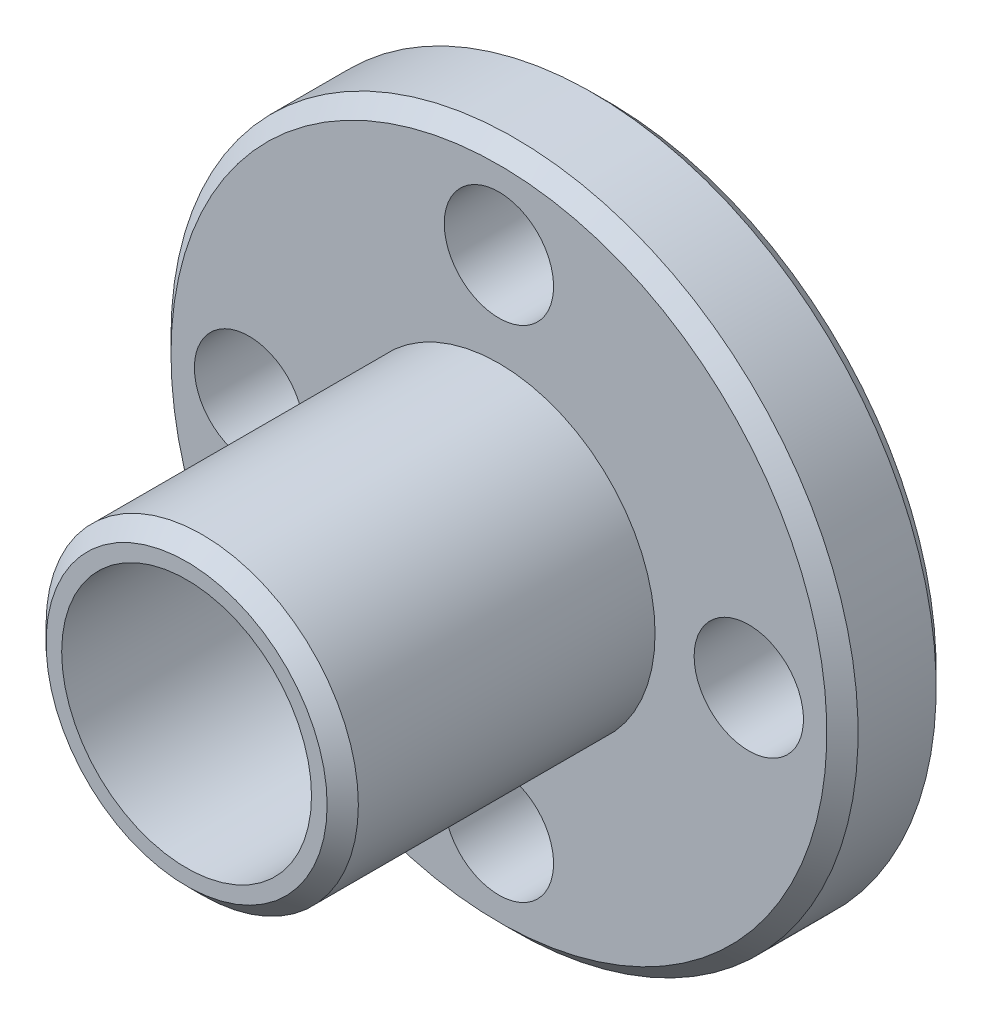
ISO-10303-21;
HEADER;
FILE_DESCRIPTION(('STEP AP214'),'2;1');
FILE_NAME('part.step','',(''),(''),'','','');
FILE_SCHEMA(('AUTOMOTIVE_DESIGN { 1 0 10303 214 1 1 1 1 }'));
ENDSEC;
DATA;
#1=APPLICATION_CONTEXT('core data for automotive mechanical design processes');
#2=APPLICATION_PROTOCOL_DEFINITION('international standard','automotive_design',2000,#1);
#3=PRODUCT_CONTEXT('',#1,'mechanical');
#4=PRODUCT('Part','Part','',(#3));
#5=PRODUCT_RELATED_PRODUCT_CATEGORY('part','',(#4));
#6=PRODUCT_DEFINITION_FORMATION('','',#4);
#7=PRODUCT_DEFINITION_CONTEXT('part definition',#1,'design');
#8=PRODUCT_DEFINITION('design','',#6,#7);
#9=PRODUCT_DEFINITION_SHAPE('','',#8);
#10=(LENGTH_UNIT() NAMED_UNIT(*) SI_UNIT(.MILLI.,.METRE.));
#11=(NAMED_UNIT(*) PLANE_ANGLE_UNIT() SI_UNIT($,.RADIAN.));
#12=(NAMED_UNIT(*) SI_UNIT($,.STERADIAN.) SOLID_ANGLE_UNIT());
#13=UNCERTAINTY_MEASURE_WITH_UNIT(LENGTH_MEASURE(1.E-05),#10,'distance_accuracy_value','');
#14=(GEOMETRIC_REPRESENTATION_CONTEXT(3) GLOBAL_UNCERTAINTY_ASSIGNED_CONTEXT((#13)) GLOBAL_UNIT_ASSIGNED_CONTEXT((#10,
#11,#12)) REPRESENTATION_CONTEXT('',''));
#15=CARTESIAN_POINT('',(0.,0.,0.));
#16=DIRECTION('',(0.,0.,1.));
#17=DIRECTION('',(1.,0.,0.));
#18=AXIS2_PLACEMENT_3D('',#15,#16,#17);
#19=CARTESIAN_POINT('',(0.,0.,7.5));
#20=DIRECTION('',(0.,0.,-1.));
#21=DIRECTION('',(-1.,0.,0.));
#22=AXIS2_PLACEMENT_3D('',#19,#20,#21);
#23=CYLINDRICAL_SURFACE('',#22,5.);
#24=CARTESIAN_POINT('',(0.,0.,6.99999999999999));
#25=DIRECTION('',(0.,0.,1.));
#26=DIRECTION('',(1.,0.,0.));
#27=AXIS2_PLACEMENT_3D('',#24,#25,#26);
#28=CIRCLE('',#27,5.);
#29=CARTESIAN_POINT('',(5.,0.,6.99999999999999));
#30=VERTEX_POINT('',#29);
#31=EDGE_CURVE('E60',#30,#30,#28,.F.);
#32=ORIENTED_EDGE('',*,*,#31,.T.);
#33=EDGE_LOOP('',(#32));
#34=FACE_BOUND('',#33,.T.);
#35=CARTESIAN_POINT('',(0.,0.,-2.5));
#36=DIRECTION('',(0.,0.,-1.));
#37=DIRECTION('',(-1.,0.,0.));
#38=AXIS2_PLACEMENT_3D('',#35,#36,#37);
#39=CIRCLE('',#38,5.);
#40=CARTESIAN_POINT('',(-5.,0.,-2.5));
#41=VERTEX_POINT('',#40);
#42=EDGE_CURVE('E66',#41,#41,#39,.T.);
#43=ORIENTED_EDGE('',*,*,#42,.F.);
#44=EDGE_LOOP('',(#43));
#45=FACE_BOUND('',#44,.T.);
#46=ADVANCED_FACE('F33',(#34,#45),#23,.T.);
#47=CARTESIAN_POINT('',(0.,0.,7.5));
#48=DIRECTION('',(0.,0.,1.));
#49=DIRECTION('',(1.,0.,0.));
#50=AXIS2_PLACEMENT_3D('',#47,#48,#49);
#51=PLANE('',#50);
#52=CARTESIAN_POINT('',(0.,0.,7.5));
#53=DIRECTION('',(0.,0.,1.));
#54=DIRECTION('',(1.,0.,0.));
#55=AXIS2_PLACEMENT_3D('',#52,#53,#54);
#56=CIRCLE('',#55,4.5);
#57=CARTESIAN_POINT('',(4.5,0.,7.5));
#58=VERTEX_POINT('',#57);
#59=EDGE_CURVE('E63',#58,#58,#56,.T.);
#60=ORIENTED_EDGE('',*,*,#59,.T.);
#61=EDGE_LOOP('',(#60));
#62=FACE_BOUND('',#61,.T.);
#63=CARTESIAN_POINT('',(0.,0.,7.5));
#64=DIRECTION('',(0.,0.,-1.));
#65=DIRECTION('',(-1.,0.,0.));
#66=AXIS2_PLACEMENT_3D('',#63,#64,#65);
#67=CIRCLE('',#66,4.);
#68=CARTESIAN_POINT('',(-4.,0.,7.5));
#69=VERTEX_POINT('',#68);
#70=EDGE_CURVE('E72',#69,#69,#67,.T.);
#71=ORIENTED_EDGE('',*,*,#70,.T.);
#72=EDGE_LOOP('',(#71));
#73=FACE_BOUND('',#72,.T.);
#74=ADVANCED_FACE('F136',(#62,#73),#51,.T.);
#75=CARTESIAN_POINT('',(0.,0.,-2.5));
#76=DIRECTION('',(0.,0.,-1.));
#77=DIRECTION('',(-1.,0.,0.));
#78=AXIS2_PLACEMENT_3D('',#75,#76,#77);
#79=CYLINDRICAL_SURFACE('',#78,11.);
#80=CARTESIAN_POINT('',(0.,0.,-3.00000000000001));
#81=DIRECTION('',(0.,0.,-1.));
#82=DIRECTION('',(-1.,0.,0.));
#83=AXIS2_PLACEMENT_3D('',#80,#81,#82);
#84=CIRCLE('',#83,11.);
#85=CARTESIAN_POINT('',(-11.,0.,-3.00000000000001));
#86=VERTEX_POINT('',#85);
#87=EDGE_CURVE('E54',#86,#86,#84,.T.);
#88=ORIENTED_EDGE('',*,*,#87,.T.);
#89=EDGE_LOOP('',(#88));
#90=FACE_BOUND('',#89,.T.);
#91=CARTESIAN_POINT('',(0.,0.,-5.5));
#92=DIRECTION('',(0.,0.,-1.));
#93=DIRECTION('',(-1.,0.,0.));
#94=AXIS2_PLACEMENT_3D('',#91,#92,#93);
#95=CIRCLE('',#94,11.);
#96=CARTESIAN_POINT('',(-11.,0.,-5.5));
#97=VERTEX_POINT('',#96);
#98=EDGE_CURVE('E57',#97,#97,#95,.F.);
#99=ORIENTED_EDGE('',*,*,#98,.T.);
#100=EDGE_LOOP('',(#99));
#101=FACE_BOUND('',#100,.T.);
#102=ADVANCED_FACE('F142',(#90,#101),#79,.T.);
#103=CARTESIAN_POINT('',(0.,0.,-2.5));
#104=DIRECTION('',(0.,0.,-1.));
#105=DIRECTION('',(-1.,0.,0.));
#106=AXIS2_PLACEMENT_3D('',#103,#104,#105);
#107=PLANE('',#106);
#108=CARTESIAN_POINT('',(0.,0.,-2.5));
#109=DIRECTION('',(0.,0.,-1.));
#110=DIRECTION('',(-1.,0.,0.));
#111=AXIS2_PLACEMENT_3D('',#108,#109,#110);
#112=CIRCLE('',#111,10.5);
#113=CARTESIAN_POINT('',(-10.5,0.,-2.5));
#114=VERTEX_POINT('',#113);
#115=EDGE_CURVE('E49',#114,#114,#112,.F.);
#116=ORIENTED_EDGE('',*,*,#115,.T.);
#117=EDGE_LOOP('',(#116));
#118=FACE_BOUND('',#117,.T.);
#119=CARTESIAN_POINT('',(0.,8.,-2.5));
#120=DIRECTION('',(0.,0.,-1.));
#121=DIRECTION('',(-1.,0.,0.));
#122=AXIS2_PLACEMENT_3D('',#119,#120,#121);
#123=CIRCLE('',#122,1.75);
#124=CARTESIAN_POINT('',(-1.75,8.,-2.5));
#125=VERTEX_POINT('',#124);
#126=EDGE_CURVE('E76',#125,#125,#123,.T.);
#127=ORIENTED_EDGE('',*,*,#126,.T.);
#128=EDGE_LOOP('',(#127));
#129=FACE_BOUND('',#128,.T.);
#130=CARTESIAN_POINT('',(-8.,0.,-2.5));
#131=DIRECTION('',(0.,0.,-1.));
#132=DIRECTION('',(-1.,0.,0.));
#133=AXIS2_PLACEMENT_3D('',#130,#131,#132);
#134=CIRCLE('',#133,1.75);
#135=CARTESIAN_POINT('',(-9.75,0.,-2.5));
#136=VERTEX_POINT('',#135);
#137=EDGE_CURVE('E81',#136,#136,#134,.T.);
#138=ORIENTED_EDGE('',*,*,#137,.T.);
#139=EDGE_LOOP('',(#138));
#140=FACE_BOUND('',#139,.T.);
#141=CARTESIAN_POINT('',(0.,-8.,-2.5));
#142=DIRECTION('',(0.,0.,-1.));
#143=DIRECTION('',(-1.,0.,0.));
#144=AXIS2_PLACEMENT_3D('',#141,#142,#143);
#145=CIRCLE('',#144,1.75);
#146=CARTESIAN_POINT('',(-1.75,-8.,-2.5));
#147=VERTEX_POINT('',#146);
#148=EDGE_CURVE('E84',#147,#147,#145,.T.);
#149=ORIENTED_EDGE('',*,*,#148,.T.);
#150=EDGE_LOOP('',(#149));
#151=FACE_BOUND('',#150,.T.);
#152=CARTESIAN_POINT('',(8.,0.,-2.5));
#153=DIRECTION('',(0.,0.,-1.));
#154=DIRECTION('',(-1.,0.,0.));
#155=AXIS2_PLACEMENT_3D('',#152,#153,#154);
#156=CIRCLE('',#155,1.75);
#157=CARTESIAN_POINT('',(6.25,0.,-2.5));
#158=VERTEX_POINT('',#157);
#159=EDGE_CURVE('E87',#158,#158,#156,.T.);
#160=ORIENTED_EDGE('',*,*,#159,.T.);
#161=EDGE_LOOP('',(#160));
#162=FACE_BOUND('',#161,.T.);
#163=ORIENTED_EDGE('',*,*,#42,.T.);
#164=EDGE_LOOP('',(#163));
#165=FACE_BOUND('',#164,.T.);
#166=ADVANCED_FACE('F110',(#118,#129,#140,#151,#162,#165),#107,.F.);
#167=CARTESIAN_POINT('',(0.,0.,-6.));
#168=DIRECTION('',(0.,0.,-1.));
#169=DIRECTION('',(-1.,0.,0.));
#170=AXIS2_PLACEMENT_3D('',#167,#168,#169);
#171=PLANE('',#170);
#172=CARTESIAN_POINT('',(0.,0.,-6.));
#173=DIRECTION('',(0.,0.,-1.));
#174=DIRECTION('',(-1.,0.,0.));
#175=AXIS2_PLACEMENT_3D('',#172,#173,#174);
#176=CIRCLE('',#175,10.5);
#177=CARTESIAN_POINT('',(-10.5,0.,-6.));
#178=VERTEX_POINT('',#177);
#179=EDGE_CURVE('E45',#178,#178,#176,.T.);
#180=ORIENTED_EDGE('',*,*,#179,.T.);
#181=EDGE_LOOP('',(#180));
#182=FACE_BOUND('',#181,.T.);
#183=CARTESIAN_POINT('',(0.,8.,-6.));
#184=DIRECTION('',(0.,0.,-1.));
#185=DIRECTION('',(-1.,0.,0.));
#186=AXIS2_PLACEMENT_3D('',#183,#184,#185);
#187=CIRCLE('',#186,1.75);
#188=CARTESIAN_POINT('',(-1.75,8.,-6.));
#189=VERTEX_POINT('',#188);
#190=EDGE_CURVE('E90',#189,#189,#187,.T.);
#191=ORIENTED_EDGE('',*,*,#190,.F.);
#192=EDGE_LOOP('',(#191));
#193=FACE_BOUND('',#192,.T.);
#194=CARTESIAN_POINT('',(-8.,0.,-6.));
#195=DIRECTION('',(0.,0.,-1.));
#196=DIRECTION('',(-1.,0.,0.));
#197=AXIS2_PLACEMENT_3D('',#194,#195,#196);
#198=CIRCLE('',#197,1.75);
#199=CARTESIAN_POINT('',(-9.75,0.,-6.));
#200=VERTEX_POINT('',#199);
#201=EDGE_CURVE('E97',#200,#200,#198,.T.);
#202=ORIENTED_EDGE('',*,*,#201,.F.);
#203=EDGE_LOOP('',(#202));
#204=FACE_BOUND('',#203,.T.);
#205=CARTESIAN_POINT('',(0.,-8.,-6.));
#206=DIRECTION('',(0.,0.,-1.));
#207=DIRECTION('',(-1.,0.,0.));
#208=AXIS2_PLACEMENT_3D('',#205,#206,#207);
#209=CIRCLE('',#208,1.75);
#210=CARTESIAN_POINT('',(-1.75,-8.,-6.));
#211=VERTEX_POINT('',#210);
#212=EDGE_CURVE('E94',#211,#211,#209,.T.);
#213=ORIENTED_EDGE('',*,*,#212,.F.);
#214=EDGE_LOOP('',(#213));
#215=FACE_BOUND('',#214,.T.);
#216=CARTESIAN_POINT('',(8.,0.,-6.));
#217=DIRECTION('',(0.,0.,-1.));
#218=DIRECTION('',(-1.,0.,0.));
#219=AXIS2_PLACEMENT_3D('',#216,#217,#218);
#220=CIRCLE('',#219,1.75);
#221=CARTESIAN_POINT('',(6.25,0.,-6.));
#222=VERTEX_POINT('',#221);
#223=EDGE_CURVE('E91',#222,#222,#220,.T.);
#224=ORIENTED_EDGE('',*,*,#223,.F.);
#225=EDGE_LOOP('',(#224));
#226=FACE_BOUND('',#225,.T.);
#227=CARTESIAN_POINT('',(0.,0.,-6.));
#228=DIRECTION('',(0.,0.,-1.));
#229=DIRECTION('',(-1.,0.,0.));
#230=AXIS2_PLACEMENT_3D('',#227,#228,#229);
#231=CIRCLE('',#230,5.);
#232=CARTESIAN_POINT('',(-5.,0.,-6.));
#233=VERTEX_POINT('',#232);
#234=EDGE_CURVE('E69',#233,#233,#231,.T.);
#235=ORIENTED_EDGE('',*,*,#234,.F.);
#236=EDGE_LOOP('',(#235));
#237=FACE_BOUND('',#236,.T.);
#238=ADVANCED_FACE('F106',(#182,#193,#204,#215,#226,#237),#171,.T.);
#239=CARTESIAN_POINT('',(0.,0.,-7.5));
#240=DIRECTION('',(0.,0.,1.));
#241=DIRECTION('',(1.,0.,0.));
#242=AXIS2_PLACEMENT_3D('',#239,#240,#241);
#243=PLANE('',#242);
#244=CARTESIAN_POINT('',(0.,0.,-7.5));
#245=DIRECTION('',(0.,0.,1.));
#246=DIRECTION('',(1.,0.,0.));
#247=AXIS2_PLACEMENT_3D('',#244,#245,#246);
#248=CIRCLE('',#247,4.5);
#249=CARTESIAN_POINT('',(4.5,0.,-7.5));
#250=VERTEX_POINT('',#249);
#251=EDGE_CURVE('E10',#250,#250,#248,.F.);
#252=ORIENTED_EDGE('',*,*,#251,.T.);
#253=EDGE_LOOP('',(#252));
#254=FACE_BOUND('',#253,.T.);
#255=CARTESIAN_POINT('',(0.,0.,-7.5));
#256=DIRECTION('',(0.,0.,-1.));
#257=DIRECTION('',(-1.,0.,0.));
#258=AXIS2_PLACEMENT_3D('',#255,#256,#257);
#259=CIRCLE('',#258,4.);
#260=CARTESIAN_POINT('',(-4.,0.,-7.5));
#261=VERTEX_POINT('',#260);
#262=EDGE_CURVE('E73',#261,#261,#259,.T.);
#263=ORIENTED_EDGE('',*,*,#262,.F.);
#264=EDGE_LOOP('',(#263));
#265=FACE_BOUND('',#264,.T.);
#266=ADVANCED_FACE('F109',(#254,#265),#243,.F.);
#267=CARTESIAN_POINT('',(0.,0.,-7.));
#268=DIRECTION('',(0.,0.,1.));
#269=DIRECTION('',(1.,0.,0.));
#270=AXIS2_PLACEMENT_3D('',#267,#268,#269);
#271=CIRCLE('',#270,5.);
#272=CARTESIAN_POINT('',(5.,0.,-7.));
#273=VERTEX_POINT('',#272);
#274=EDGE_CURVE('E41',#273,#273,#271,.T.);
#275=ORIENTED_EDGE('',*,*,#274,.T.);
#276=EDGE_LOOP('',(#275));
#277=FACE_BOUND('',#276,.T.);
#278=ORIENTED_EDGE('',*,*,#234,.T.);
#279=EDGE_LOOP('',(#278));
#280=FACE_BOUND('',#279,.T.);
#281=ADVANCED_FACE('F121',(#277,#280),#23,.T.);
#282=CARTESIAN_POINT('',(0.,0.,7.5));
#283=DIRECTION('',(0.,0.,-1.));
#284=DIRECTION('',(-1.,0.,0.));
#285=AXIS2_PLACEMENT_3D('',#282,#283,#284);
#286=CYLINDRICAL_SURFACE('',#285,4.);
#287=ORIENTED_EDGE('',*,*,#70,.F.);
#288=EDGE_LOOP('',(#287));
#289=FACE_BOUND('',#288,.T.);
#290=ORIENTED_EDGE('',*,*,#262,.T.);
#291=EDGE_LOOP('',(#290));
#292=FACE_BOUND('',#291,.T.);
#293=ADVANCED_FACE('F123',(#289,#292),#286,.F.);
#294=CARTESIAN_POINT('',(8.,0.,7.5));
#295=DIRECTION('',(0.,0.,-1.));
#296=DIRECTION('',(-1.,0.,0.));
#297=AXIS2_PLACEMENT_3D('',#294,#295,#296);
#298=CYLINDRICAL_SURFACE('',#297,1.75);
#299=ORIENTED_EDGE('',*,*,#223,.T.);
#300=EDGE_LOOP('',(#299));
#301=FACE_BOUND('',#300,.T.);
#302=ORIENTED_EDGE('',*,*,#159,.F.);
#303=EDGE_LOOP('',(#302));
#304=FACE_BOUND('',#303,.T.);
#305=ADVANCED_FACE('F130',(#301,#304),#298,.F.);
#306=CARTESIAN_POINT('',(0.,-8.,7.5));
#307=DIRECTION('',(0.,0.,-1.));
#308=DIRECTION('',(-1.,0.,0.));
#309=AXIS2_PLACEMENT_3D('',#306,#307,#308);
#310=CYLINDRICAL_SURFACE('',#309,1.75);
#311=ORIENTED_EDGE('',*,*,#212,.T.);
#312=EDGE_LOOP('',(#311));
#313=FACE_BOUND('',#312,.T.);
#314=ORIENTED_EDGE('',*,*,#148,.F.);
#315=EDGE_LOOP('',(#314));
#316=FACE_BOUND('',#315,.T.);
#317=ADVANCED_FACE('F161',(#313,#316),#310,.F.);
#318=CARTESIAN_POINT('',(-8.,0.,7.5));
#319=DIRECTION('',(0.,0.,-1.));
#320=DIRECTION('',(-1.,0.,0.));
#321=AXIS2_PLACEMENT_3D('',#318,#319,#320);
#322=CYLINDRICAL_SURFACE('',#321,1.75);
#323=ORIENTED_EDGE('',*,*,#201,.T.);
#324=EDGE_LOOP('',(#323));
#325=FACE_BOUND('',#324,.T.);
#326=ORIENTED_EDGE('',*,*,#137,.F.);
#327=EDGE_LOOP('',(#326));
#328=FACE_BOUND('',#327,.T.);
#329=ADVANCED_FACE('F165',(#325,#328),#322,.F.);
#330=CARTESIAN_POINT('',(0.,8.,7.5));
#331=DIRECTION('',(0.,0.,-1.));
#332=DIRECTION('',(-1.,0.,0.));
#333=AXIS2_PLACEMENT_3D('',#330,#331,#332);
#334=CYLINDRICAL_SURFACE('',#333,1.75);
#335=ORIENTED_EDGE('',*,*,#190,.T.);
#336=EDGE_LOOP('',(#335));
#337=FACE_BOUND('',#336,.T.);
#338=ORIENTED_EDGE('',*,*,#126,.F.);
#339=EDGE_LOOP('',(#338));
#340=FACE_BOUND('',#339,.T.);
#341=ADVANCED_FACE('F103',(#337,#340),#334,.F.);
#342=CARTESIAN_POINT('',(0.,0.,7.5));
#343=DIRECTION('',(0.,0.,-1.));
#344=DIRECTION('',(-1.,0.,0.));
#345=AXIS2_PLACEMENT_3D('',#342,#343,#344);
#346=CONICAL_SURFACE('',#345,4.5,0.785398163397445);
#347=ORIENTED_EDGE('',*,*,#31,.F.);
#348=EDGE_LOOP('',(#347));
#349=FACE_BOUND('',#348,.T.);
#350=ORIENTED_EDGE('',*,*,#59,.F.);
#351=EDGE_LOOP('',(#350));
#352=FACE_BOUND('',#351,.T.);
#353=ADVANCED_FACE('F171',(#349,#352),#346,.T.);
#354=CARTESIAN_POINT('',(0.,0.,-3.00000000000001));
#355=DIRECTION('',(0.,0.,-1.));
#356=DIRECTION('',(-1.,0.,0.));
#357=AXIS2_PLACEMENT_3D('',#354,#355,#356);
#358=CONICAL_SURFACE('',#357,11.,0.785398163397448);
#359=ORIENTED_EDGE('',*,*,#115,.F.);
#360=EDGE_LOOP('',(#359));
#361=FACE_BOUND('',#360,.T.);
#362=ORIENTED_EDGE('',*,*,#87,.F.);
#363=EDGE_LOOP('',(#362));
#364=FACE_BOUND('',#363,.T.);
#365=ADVANCED_FACE('F174',(#361,#364),#358,.T.);
#366=CARTESIAN_POINT('',(0.,0.,-6.));
#367=DIRECTION('',(0.,0.,1.));
#368=DIRECTION('',(1.,0.,0.));
#369=AXIS2_PLACEMENT_3D('',#366,#367,#368);
#370=CONICAL_SURFACE('',#369,10.5,0.785398163397448);
#371=ORIENTED_EDGE('',*,*,#98,.F.);
#372=EDGE_LOOP('',(#371));
#373=FACE_BOUND('',#372,.T.);
#374=ORIENTED_EDGE('',*,*,#179,.F.);
#375=EDGE_LOOP('',(#374));
#376=FACE_BOUND('',#375,.T.);
#377=ADVANCED_FACE('F178',(#373,#376),#370,.T.);
#378=CARTESIAN_POINT('',(0.,0.,-7.));
#379=DIRECTION('',(0.,0.,1.));
#380=DIRECTION('',(1.,0.,0.));
#381=AXIS2_PLACEMENT_3D('',#378,#379,#380);
#382=CONICAL_SURFACE('',#381,5.,0.785398163397447);
#383=ORIENTED_EDGE('',*,*,#251,.F.);
#384=EDGE_LOOP('',(#383));
#385=FACE_BOUND('',#384,.T.);
#386=ORIENTED_EDGE('',*,*,#274,.F.);
#387=EDGE_LOOP('',(#386));
#388=FACE_BOUND('',#387,.T.);
#389=ADVANCED_FACE('F36',(#385,#388),#382,.T.);
#390=CLOSED_SHELL('',(#46,#74,#102,#166,#238,#266,#281,#293,#305,#317,#329,#341,#353,#365,#377,#389));
#391=MANIFOLD_SOLID_BREP('B2',#390);
#392=ADVANCED_BREP_SHAPE_REPRESENTATION('',(#18,#391),#14);
#393=SHAPE_DEFINITION_REPRESENTATION(#9,#392);
ENDSEC;
END-ISO-10303-21;
